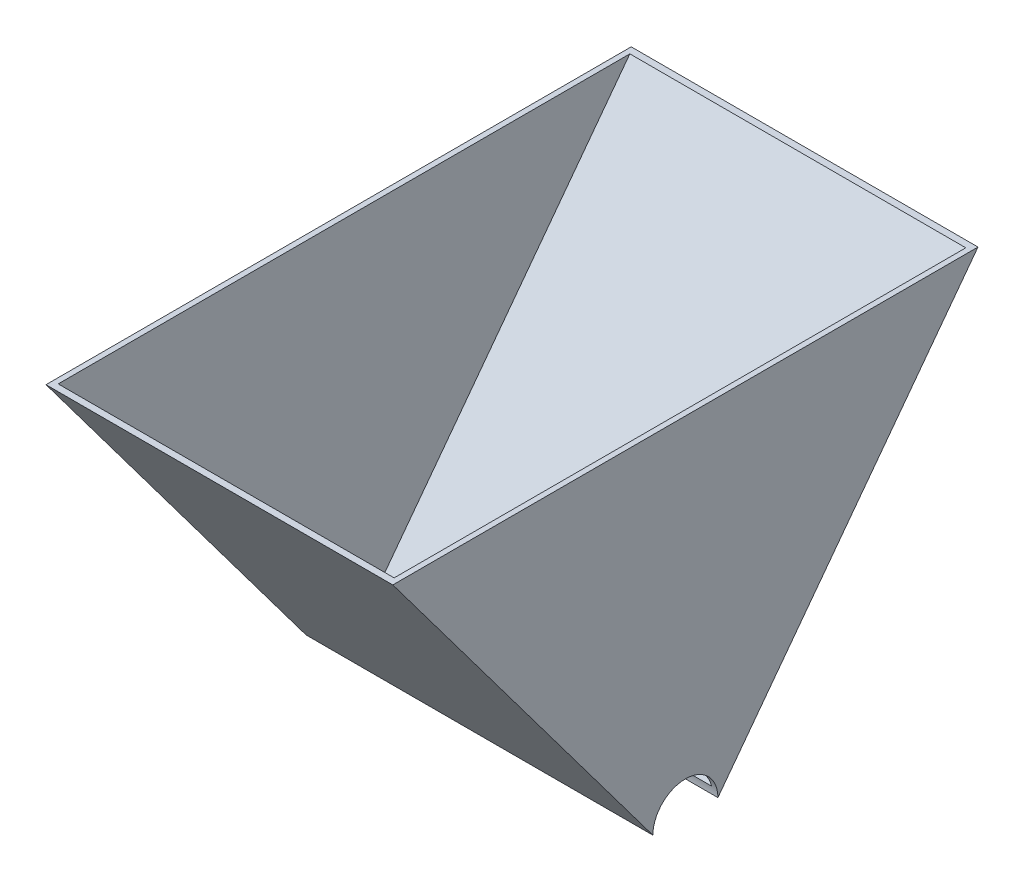
ISO-10303-21;
HEADER;
FILE_DESCRIPTION(('STEP AP214'),'2;1');
FILE_NAME('part.step','',(''),(''),'','','');
FILE_SCHEMA(('AUTOMOTIVE_DESIGN { 1 0 10303 214 1 1 1 1 }'));
ENDSEC;
DATA;
#1=APPLICATION_CONTEXT('core data for automotive mechanical design processes');
#2=APPLICATION_PROTOCOL_DEFINITION('international standard','automotive_design',2000,#1);
#3=PRODUCT_CONTEXT('',#1,'mechanical');
#4=PRODUCT('Part','Part','',(#3));
#5=PRODUCT_RELATED_PRODUCT_CATEGORY('part','',(#4));
#6=PRODUCT_DEFINITION_FORMATION('','',#4);
#7=PRODUCT_DEFINITION_CONTEXT('part definition',#1,'design');
#8=PRODUCT_DEFINITION('design','',#6,#7);
#9=PRODUCT_DEFINITION_SHAPE('','',#8);
#10=(LENGTH_UNIT() NAMED_UNIT(*) SI_UNIT(.MILLI.,.METRE.));
#11=(NAMED_UNIT(*) PLANE_ANGLE_UNIT() SI_UNIT($,.RADIAN.));
#12=(NAMED_UNIT(*) SI_UNIT($,.STERADIAN.) SOLID_ANGLE_UNIT());
#13=UNCERTAINTY_MEASURE_WITH_UNIT(LENGTH_MEASURE(1.E-05),#10,'distance_accuracy_value','');
#14=(GEOMETRIC_REPRESENTATION_CONTEXT(3) GLOBAL_UNCERTAINTY_ASSIGNED_CONTEXT((#13)) GLOBAL_UNIT_ASSIGNED_CONTEXT((#10,
#11,#12)) REPRESENTATION_CONTEXT('',''));
#15=CARTESIAN_POINT('',(0.,0.,0.));
#16=DIRECTION('',(0.,0.,1.));
#17=DIRECTION('',(1.,0.,0.));
#18=AXIS2_PLACEMENT_3D('',#15,#16,#17);
#19=CARTESIAN_POINT('',(101.6,0.,0.));
#20=DIRECTION('',(-1.,0.,0.));
#21=DIRECTION('',(0.,0.,1.));
#22=AXIS2_PLACEMENT_3D('',#19,#20,#21);
#23=CYLINDRICAL_SURFACE('',#22,9.525);
#24=CARTESIAN_POINT('',(0.,0.,0.));
#25=DIRECTION('',(-1.,0.,0.));
#26=DIRECTION('',(0.,0.,1.));
#27=AXIS2_PLACEMENT_3D('',#24,#25,#26);
#28=CIRCLE('',#27,9.525);
#29=CARTESIAN_POINT('',(0.,0.,9.525));
#30=VERTEX_POINT('',#29);
#31=CARTESIAN_POINT('',(0.,0.,-9.525));
#32=VERTEX_POINT('',#31);
#33=EDGE_CURVE('E126',#30,#32,#28,.T.);
#34=ORIENTED_EDGE('',*,*,#33,.T.);
#35=DIRECTION('',(-1.,0.,0.));
#36=VECTOR('',#35,1.);
#37=CARTESIAN_POINT('',(101.6,0.,-9.525));
#38=LINE('',#37,#36);
#39=CARTESIAN_POINT('',(101.6,0.,-9.525));
#40=VERTEX_POINT('',#39);
#41=EDGE_CURVE('E11',#40,#32,#38,.T.);
#42=ORIENTED_EDGE('',*,*,#41,.F.);
#43=CARTESIAN_POINT('',(101.6,0.,0.));
#44=DIRECTION('',(-1.,0.,0.));
#45=DIRECTION('',(0.,0.,1.));
#46=AXIS2_PLACEMENT_3D('',#43,#44,#45);
#47=CIRCLE('',#46,9.525);
#48=CARTESIAN_POINT('',(101.6,0.,9.525));
#49=VERTEX_POINT('',#48);
#50=EDGE_CURVE('E131',#49,#40,#47,.T.);
#51=ORIENTED_EDGE('',*,*,#50,.F.);
#52=DIRECTION('',(-1.,0.,0.));
#53=VECTOR('',#52,1.);
#54=CARTESIAN_POINT('',(101.6,0.,9.525));
#55=LINE('',#54,#53);
#56=EDGE_CURVE('E141',#49,#30,#55,.T.);
#57=ORIENTED_EDGE('',*,*,#56,.T.);
#58=EDGE_LOOP('',(#34,#42,#51,#57));
#59=FACE_BOUND('',#58,.T.);
#60=CARTESIAN_POINT('',(1.58750000000001,0.,0.));
#61=DIRECTION('',(-1.,0.,0.));
#62=DIRECTION('',(0.,0.,1.));
#63=AXIS2_PLACEMENT_3D('',#60,#61,#62);
#64=CIRCLE('',#63,9.525);
#65=CARTESIAN_POINT('',(1.5875,2.27745887725191,9.24871915793893));
#66=VERTEX_POINT('',#65);
#67=CARTESIAN_POINT('',(1.5875,2.27745887725191,-9.24871915793894));
#68=VERTEX_POINT('',#67);
#69=EDGE_CURVE('E102',#66,#68,#64,.T.);
#70=ORIENTED_EDGE('',*,*,#69,.F.);
#71=DIRECTION('',(-1.,0.,0.));
#72=VECTOR('',#71,1.);
#73=CARTESIAN_POINT('',(100.0125,2.27745887725191,9.24871915793893));
#74=LINE('',#73,#72);
#75=CARTESIAN_POINT('',(100.0125,2.27745887725191,9.24871915793893));
#76=VERTEX_POINT('',#75);
#77=EDGE_CURVE('E122',#76,#66,#74,.T.);
#78=ORIENTED_EDGE('',*,*,#77,.F.);
#79=CARTESIAN_POINT('',(100.0125,0.,0.));
#80=DIRECTION('',(-1.,0.,0.));
#81=DIRECTION('',(0.,0.,1.));
#82=AXIS2_PLACEMENT_3D('',#79,#80,#81);
#83=CIRCLE('',#82,9.525);
#84=CARTESIAN_POINT('',(100.0125,2.27745887725191,-9.24871915793894));
#85=VERTEX_POINT('',#84);
#86=EDGE_CURVE('E46',#76,#85,#83,.T.);
#87=ORIENTED_EDGE('',*,*,#86,.T.);
#88=DIRECTION('',(-1.,0.,0.));
#89=VECTOR('',#88,1.);
#90=CARTESIAN_POINT('',(100.0125,2.27745887725191,-9.24871915793894));
#91=LINE('',#90,#89);
#92=EDGE_CURVE('E112',#85,#68,#91,.T.);
#93=ORIENTED_EDGE('',*,*,#92,.T.);
#94=EDGE_LOOP('',(#70,#78,#87,#93));
#95=FACE_BOUND('',#94,.T.);
#96=ADVANCED_FACE('F32',(#59,#95),#23,.F.);
#97=CARTESIAN_POINT('',(101.6,101.6,85.725));
#98=DIRECTION('',(0.,-1.,0.));
#99=DIRECTION('',(0.,0.,-1.));
#100=AXIS2_PLACEMENT_3D('',#97,#98,#99);
#101=PLANE('',#100);
#102=DIRECTION('',(0.,0.,1.));
#103=VECTOR('',#102,1.);
#104=CARTESIAN_POINT('',(0.,101.6,85.725));
#105=LINE('',#104,#103);
#106=CARTESIAN_POINT('',(0.,101.6,-85.725));
#107=VERTEX_POINT('',#106);
#108=CARTESIAN_POINT('',(0.,101.6,85.725));
#109=VERTEX_POINT('',#108);
#110=EDGE_CURVE('E146',#107,#109,#105,.T.);
#111=ORIENTED_EDGE('',*,*,#110,.T.);
#112=DIRECTION('',(-1.,0.,0.));
#113=VECTOR('',#112,1.);
#114=CARTESIAN_POINT('',(101.6,101.6,85.725));
#115=LINE('',#114,#113);
#116=CARTESIAN_POINT('',(101.6,101.6,85.725));
#117=VERTEX_POINT('',#116);
#118=EDGE_CURVE('E151',#117,#109,#115,.T.);
#119=ORIENTED_EDGE('',*,*,#118,.F.);
#120=DIRECTION('',(0.,0.,1.));
#121=VECTOR('',#120,1.);
#122=CARTESIAN_POINT('',(101.6,101.6,85.725));
#123=LINE('',#122,#121);
#124=CARTESIAN_POINT('',(101.6,101.6,-85.725));
#125=VERTEX_POINT('',#124);
#126=EDGE_CURVE('E137',#125,#117,#123,.T.);
#127=ORIENTED_EDGE('',*,*,#126,.F.);
#128=DIRECTION('',(-1.,0.,0.));
#129=VECTOR('',#128,1.);
#130=CARTESIAN_POINT('',(101.6,101.6,-85.725));
#131=LINE('',#130,#129);
#132=EDGE_CURVE('E39',#125,#107,#131,.T.);
#133=ORIENTED_EDGE('',*,*,#132,.T.);
#134=EDGE_LOOP('',(#111,#119,#127,#133));
#135=FACE_BOUND('',#134,.T.);
#136=DIRECTION('',(0.,0.,1.));
#137=VECTOR('',#136,1.);
#138=CARTESIAN_POINT('',(1.5875,101.6,0.));
#139=LINE('',#138,#137);
#140=CARTESIAN_POINT('',(1.5875,101.6,-83.740625));
#141=VERTEX_POINT('',#140);
#142=CARTESIAN_POINT('',(1.5875,101.6,83.740625));
#143=VERTEX_POINT('',#142);
#144=EDGE_CURVE('E99',#141,#143,#139,.T.);
#145=ORIENTED_EDGE('',*,*,#144,.F.);
#146=DIRECTION('',(-1.,0.,0.));
#147=VECTOR('',#146,1.);
#148=CARTESIAN_POINT('',(101.6,101.6,-83.740625));
#149=LINE('',#148,#147);
#150=CARTESIAN_POINT('',(100.0125,101.6,-83.740625));
#151=VERTEX_POINT('',#150);
#152=EDGE_CURVE('E108',#151,#141,#149,.T.);
#153=ORIENTED_EDGE('',*,*,#152,.F.);
#154=DIRECTION('',(0.,0.,1.));
#155=VECTOR('',#154,1.);
#156=CARTESIAN_POINT('',(100.0125,101.6,0.));
#157=LINE('',#156,#155);
#158=CARTESIAN_POINT('',(100.0125,101.6,83.740625));
#159=VERTEX_POINT('',#158);
#160=EDGE_CURVE('E51',#151,#159,#157,.T.);
#161=ORIENTED_EDGE('',*,*,#160,.T.);
#162=DIRECTION('',(-1.,0.,0.));
#163=VECTOR('',#162,1.);
#164=CARTESIAN_POINT('',(101.6,101.6,83.740625));
#165=LINE('',#164,#163);
#166=EDGE_CURVE('E113',#159,#143,#165,.T.);
#167=ORIENTED_EDGE('',*,*,#166,.T.);
#168=EDGE_LOOP('',(#145,#153,#161,#167));
#169=FACE_BOUND('',#168,.T.);
#170=ADVANCED_FACE('F116',(#135,#169),#101,.F.);
#171=CARTESIAN_POINT('',(101.6,101.6,-85.725));
#172=DIRECTION('',(0.,0.6,0.8));
#173=DIRECTION('',(0.,-0.8,0.6));
#174=AXIS2_PLACEMENT_3D('',#171,#172,#173);
#175=PLANE('',#174);
#176=DIRECTION('',(0.,0.8,-0.6));
#177=VECTOR('',#176,1.);
#178=CARTESIAN_POINT('',(0.,101.6,-85.725));
#179=LINE('',#178,#177);
#180=EDGE_CURVE('E144',#32,#107,#179,.T.);
#181=ORIENTED_EDGE('',*,*,#180,.T.);
#182=ORIENTED_EDGE('',*,*,#132,.F.);
#183=DIRECTION('',(0.,0.8,-0.6));
#184=VECTOR('',#183,1.);
#185=CARTESIAN_POINT('',(101.6,101.6,-85.725));
#186=LINE('',#185,#184);
#187=EDGE_CURVE('E134',#40,#125,#186,.T.);
#188=ORIENTED_EDGE('',*,*,#187,.F.);
#189=ORIENTED_EDGE('',*,*,#41,.T.);
#190=EDGE_LOOP('',(#181,#182,#188,#189));
#191=FACE_BOUND('',#190,.T.);
#192=ADVANCED_FACE('F174',(#191),#175,.F.);
#193=CARTESIAN_POINT('',(101.6,0.,9.525));
#194=DIRECTION('',(0.,0.6,-0.8));
#195=DIRECTION('',(0.,0.8,0.6));
#196=AXIS2_PLACEMENT_3D('',#193,#194,#195);
#197=PLANE('',#196);
#198=DIRECTION('',(0.,-0.8,-0.6));
#199=VECTOR('',#198,1.);
#200=CARTESIAN_POINT('',(0.,0.,9.525));
#201=LINE('',#200,#199);
#202=EDGE_CURVE('E135',#109,#30,#201,.T.);
#203=ORIENTED_EDGE('',*,*,#202,.T.);
#204=ORIENTED_EDGE('',*,*,#56,.F.);
#205=DIRECTION('',(0.,-0.8,-0.6));
#206=VECTOR('',#205,1.);
#207=CARTESIAN_POINT('',(101.6,0.,9.525));
#208=LINE('',#207,#206);
#209=EDGE_CURVE('E139',#117,#49,#208,.T.);
#210=ORIENTED_EDGE('',*,*,#209,.F.);
#211=ORIENTED_EDGE('',*,*,#118,.T.);
#212=EDGE_LOOP('',(#203,#204,#210,#211));
#213=FACE_BOUND('',#212,.T.);
#214=ADVANCED_FACE('F166',(#213),#197,.F.);
#215=CARTESIAN_POINT('',(101.6,0.,0.));
#216=DIRECTION('',(-1.,0.,0.));
#217=DIRECTION('',(0.,0.,1.));
#218=AXIS2_PLACEMENT_3D('',#215,#216,#217);
#219=PLANE('',#218);
#220=ORIENTED_EDGE('',*,*,#50,.T.);
#221=ORIENTED_EDGE('',*,*,#187,.T.);
#222=ORIENTED_EDGE('',*,*,#126,.T.);
#223=ORIENTED_EDGE('',*,*,#209,.T.);
#224=EDGE_LOOP('',(#220,#221,#222,#223));
#225=FACE_BOUND('',#224,.T.);
#226=ADVANCED_FACE('F173',(#225),#219,.F.);
#227=CARTESIAN_POINT('',(0.,0.,0.));
#228=DIRECTION('',(-1.,0.,0.));
#229=DIRECTION('',(0.,0.,1.));
#230=AXIS2_PLACEMENT_3D('',#227,#228,#229);
#231=PLANE('',#230);
#232=ORIENTED_EDGE('',*,*,#33,.F.);
#233=ORIENTED_EDGE('',*,*,#202,.F.);
#234=ORIENTED_EDGE('',*,*,#110,.F.);
#235=ORIENTED_EDGE('',*,*,#180,.F.);
#236=EDGE_LOOP('',(#232,#233,#234,#235));
#237=FACE_BOUND('',#236,.T.);
#238=ADVANCED_FACE('F163',(#237),#231,.T.);
#239=CARTESIAN_POINT('',(101.6,102.5525,-84.455));
#240=DIRECTION('',(0.,0.6,0.8));
#241=DIRECTION('',(0.,-0.8,0.6));
#242=AXIS2_PLACEMENT_3D('',#239,#240,#241);
#243=PLANE('',#242);
#244=DIRECTION('',(0.,0.8,-0.6));
#245=VECTOR('',#244,1.);
#246=CARTESIAN_POINT('',(1.5875,-3.6195,-4.826));
#247=LINE('',#246,#245);
#248=EDGE_CURVE('E95',#68,#141,#247,.T.);
#249=ORIENTED_EDGE('',*,*,#248,.F.);
#250=ORIENTED_EDGE('',*,*,#92,.F.);
#251=DIRECTION('',(0.,0.8,-0.6));
#252=VECTOR('',#251,1.);
#253=CARTESIAN_POINT('',(100.0125,-3.6195,-4.826));
#254=LINE('',#253,#252);
#255=EDGE_CURVE('E110',#85,#151,#254,.T.);
#256=ORIENTED_EDGE('',*,*,#255,.T.);
#257=ORIENTED_EDGE('',*,*,#152,.T.);
#258=EDGE_LOOP('',(#249,#250,#256,#257));
#259=FACE_BOUND('',#258,.T.);
#260=ADVANCED_FACE('F109',(#259),#243,.T.);
#261=CARTESIAN_POINT('',(101.6,0.9525,8.255));
#262=DIRECTION('',(0.,0.6,-0.8));
#263=DIRECTION('',(0.,0.8,0.6));
#264=AXIS2_PLACEMENT_3D('',#261,#262,#263);
#265=PLANE('',#264);
#266=DIRECTION('',(0.,-0.8,-0.6));
#267=VECTOR('',#266,1.);
#268=CARTESIAN_POINT('',(1.5875,-3.6195,4.826));
#269=LINE('',#268,#267);
#270=EDGE_CURVE('E117',#143,#66,#269,.T.);
#271=ORIENTED_EDGE('',*,*,#270,.F.);
#272=ORIENTED_EDGE('',*,*,#166,.F.);
#273=DIRECTION('',(0.,-0.8,-0.6));
#274=VECTOR('',#273,1.);
#275=CARTESIAN_POINT('',(100.0125,-3.6195,4.826));
#276=LINE('',#275,#274);
#277=EDGE_CURVE('E124',#159,#76,#276,.T.);
#278=ORIENTED_EDGE('',*,*,#277,.T.);
#279=ORIENTED_EDGE('',*,*,#77,.T.);
#280=EDGE_LOOP('',(#271,#272,#278,#279));
#281=FACE_BOUND('',#280,.T.);
#282=ADVANCED_FACE('F200',(#281),#265,.T.);
#283=CARTESIAN_POINT('',(100.0125,0.,0.));
#284=DIRECTION('',(-1.,0.,0.));
#285=DIRECTION('',(0.,0.,1.));
#286=AXIS2_PLACEMENT_3D('',#283,#284,#285);
#287=PLANE('',#286);
#288=ORIENTED_EDGE('',*,*,#86,.F.);
#289=ORIENTED_EDGE('',*,*,#277,.F.);
#290=ORIENTED_EDGE('',*,*,#160,.F.);
#291=ORIENTED_EDGE('',*,*,#255,.F.);
#292=EDGE_LOOP('',(#288,#289,#290,#291));
#293=FACE_BOUND('',#292,.T.);
#294=ADVANCED_FACE('F210',(#293),#287,.T.);
#295=CARTESIAN_POINT('',(1.5875,0.,0.));
#296=DIRECTION('',(-1.,0.,0.));
#297=DIRECTION('',(0.,0.,1.));
#298=AXIS2_PLACEMENT_3D('',#295,#296,#297);
#299=PLANE('',#298);
#300=ORIENTED_EDGE('',*,*,#69,.T.);
#301=ORIENTED_EDGE('',*,*,#248,.T.);
#302=ORIENTED_EDGE('',*,*,#144,.T.);
#303=ORIENTED_EDGE('',*,*,#270,.T.);
#304=EDGE_LOOP('',(#300,#301,#302,#303));
#305=FACE_BOUND('',#304,.T.);
#306=ADVANCED_FACE('F97',(#305),#299,.F.);
#307=CLOSED_SHELL('',(#96,#170,#192,#214,#226,#238,#260,#282,#294,#306));
#308=MANIFOLD_SOLID_BREP('B2',#307);
#309=ADVANCED_BREP_SHAPE_REPRESENTATION('',(#18,#308),#14);
#310=SHAPE_DEFINITION_REPRESENTATION(#9,#309);
ENDSEC;
END-ISO-10303-21;
